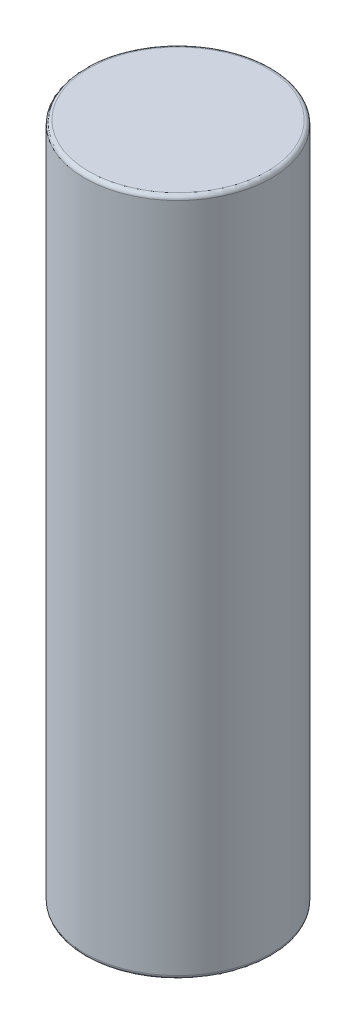
ISO-10303-21;
HEADER;
FILE_DESCRIPTION(('STEP AP214'),'2;1');
FILE_NAME('part.step','',(''),(''),'','','');
FILE_SCHEMA(('AUTOMOTIVE_DESIGN { 1 0 10303 214 1 1 1 1 }'));
ENDSEC;
DATA;
#1=APPLICATION_CONTEXT('core data for automotive mechanical design processes');
#2=APPLICATION_PROTOCOL_DEFINITION('international standard','automotive_design',2000,#1);
#3=PRODUCT_CONTEXT('',#1,'mechanical');
#4=PRODUCT('Part','Part','',(#3));
#5=PRODUCT_RELATED_PRODUCT_CATEGORY('part','',(#4));
#6=PRODUCT_DEFINITION_FORMATION('','',#4);
#7=PRODUCT_DEFINITION_CONTEXT('part definition',#1,'design');
#8=PRODUCT_DEFINITION('design','',#6,#7);
#9=PRODUCT_DEFINITION_SHAPE('','',#8);
#10=(LENGTH_UNIT() NAMED_UNIT(*) SI_UNIT(.MILLI.,.METRE.));
#11=(NAMED_UNIT(*) PLANE_ANGLE_UNIT() SI_UNIT($,.RADIAN.));
#12=(NAMED_UNIT(*) SI_UNIT($,.STERADIAN.) SOLID_ANGLE_UNIT());
#13=UNCERTAINTY_MEASURE_WITH_UNIT(LENGTH_MEASURE(1.E-05),#10,'distance_accuracy_value','');
#14=(GEOMETRIC_REPRESENTATION_CONTEXT(3) GLOBAL_UNCERTAINTY_ASSIGNED_CONTEXT((#13)) GLOBAL_UNIT_ASSIGNED_CONTEXT((#10,
#11,#12)) REPRESENTATION_CONTEXT('',''));
#15=CARTESIAN_POINT('',(0.,0.,0.));
#16=DIRECTION('',(0.,0.,1.));
#17=DIRECTION('',(1.,0.,0.));
#18=AXIS2_PLACEMENT_3D('',#15,#16,#17);
#19=CARTESIAN_POINT('',(0.,51.,0.));
#20=DIRECTION('',(0.,-1.,0.));
#21=DIRECTION('',(0.,0.,-1.));
#22=AXIS2_PLACEMENT_3D('',#19,#20,#21);
#23=CYLINDRICAL_SURFACE('',#22,7.);
#24=CARTESIAN_POINT('',(0.,0.300000000000002,0.));
#25=DIRECTION('',(0.,1.,0.));
#26=DIRECTION('',(0.,0.,1.));
#27=AXIS2_PLACEMENT_3D('',#24,#25,#26);
#28=CIRCLE('',#27,7.);
#29=CARTESIAN_POINT('',(0.,0.300000000000002,7.));
#30=VERTEX_POINT('',#29);
#31=EDGE_CURVE('E45',#30,#30,#28,.T.);
#32=ORIENTED_EDGE('',*,*,#31,.T.);
#33=EDGE_LOOP('',(#32));
#34=FACE_BOUND('',#33,.T.);
#35=CARTESIAN_POINT('',(0.,50.7,0.));
#36=DIRECTION('',(0.,1.,0.));
#37=DIRECTION('',(0.,0.,1.));
#38=AXIS2_PLACEMENT_3D('',#35,#36,#37);
#39=CIRCLE('',#38,7.);
#40=CARTESIAN_POINT('',(0.,50.7,7.));
#41=VERTEX_POINT('',#40);
#42=EDGE_CURVE('E49',#41,#41,#39,.F.);
#43=ORIENTED_EDGE('',*,*,#42,.T.);
#44=EDGE_LOOP('',(#43));
#45=FACE_BOUND('',#44,.T.);
#46=ADVANCED_FACE('F34',(#34,#45),#23,.T.);
#47=CARTESIAN_POINT('',(0.,51.,0.));
#48=DIRECTION('',(0.,1.,0.));
#49=DIRECTION('',(0.,0.,1.));
#50=AXIS2_PLACEMENT_3D('',#47,#48,#49);
#51=PLANE('',#50);
#52=CARTESIAN_POINT('',(0.,51.,0.));
#53=DIRECTION('',(0.,1.,0.));
#54=DIRECTION('',(0.,0.,1.));
#55=AXIS2_PLACEMENT_3D('',#52,#53,#54);
#56=CIRCLE('',#55,6.7);
#57=CARTESIAN_POINT('',(0.,51.,6.7));
#58=VERTEX_POINT('',#57);
#59=EDGE_CURVE('E10',#58,#58,#56,.T.);
#60=ORIENTED_EDGE('',*,*,#59,.T.);
#61=EDGE_LOOP('',(#60));
#62=FACE_BOUND('',#61,.T.);
#63=ADVANCED_FACE('F65',(#62),#51,.T.);
#64=CARTESIAN_POINT('',(0.,0.,0.));
#65=DIRECTION('',(0.,1.,0.));
#66=DIRECTION('',(0.,0.,1.));
#67=AXIS2_PLACEMENT_3D('',#64,#65,#66);
#68=PLANE('',#67);
#69=CARTESIAN_POINT('',(0.,0.,0.));
#70=DIRECTION('',(0.,1.,0.));
#71=DIRECTION('',(0.,0.,1.));
#72=AXIS2_PLACEMENT_3D('',#69,#70,#71);
#73=CIRCLE('',#72,6.7);
#74=CARTESIAN_POINT('',(0.,0.,6.7));
#75=VERTEX_POINT('',#74);
#76=EDGE_CURVE('E41',#75,#75,#73,.F.);
#77=ORIENTED_EDGE('',*,*,#76,.T.);
#78=EDGE_LOOP('',(#77));
#79=FACE_BOUND('',#78,.T.);
#80=ADVANCED_FACE('F62',(#79),#68,.F.);
#81=CARTESIAN_POINT('',(0.,0.300000000000002,0.));
#82=DIRECTION('',(0.,1.,0.));
#83=DIRECTION('',(0.,0.,1.));
#84=AXIS2_PLACEMENT_3D('',#81,#82,#83);
#85=TOROIDAL_SURFACE('',#84,6.7,0.3);
#86=ORIENTED_EDGE('',*,*,#76,.F.);
#87=EDGE_LOOP('',(#86));
#88=FACE_BOUND('',#87,.T.);
#89=ORIENTED_EDGE('',*,*,#31,.F.);
#90=EDGE_LOOP('',(#89));
#91=FACE_BOUND('',#90,.T.);
#92=ADVANCED_FACE('F58',(#88,#91),#85,.T.);
#93=CARTESIAN_POINT('',(0.,50.7,0.));
#94=DIRECTION('',(0.,1.,0.));
#95=DIRECTION('',(0.,0.,1.));
#96=AXIS2_PLACEMENT_3D('',#93,#94,#95);
#97=TOROIDAL_SURFACE('',#96,6.7,0.3);
#98=ORIENTED_EDGE('',*,*,#42,.F.);
#99=EDGE_LOOP('',(#98));
#100=FACE_BOUND('',#99,.T.);
#101=ORIENTED_EDGE('',*,*,#59,.F.);
#102=EDGE_LOOP('',(#101));
#103=FACE_BOUND('',#102,.T.);
#104=ADVANCED_FACE('F36',(#100,#103),#97,.T.);
#105=CLOSED_SHELL('',(#46,#63,#80,#92,#104));
#106=MANIFOLD_SOLID_BREP('B2',#105);
#107=ADVANCED_BREP_SHAPE_REPRESENTATION('',(#18,#106),#14);
#108=SHAPE_DEFINITION_REPRESENTATION(#9,#107);
ENDSEC;
END-ISO-10303-21;
